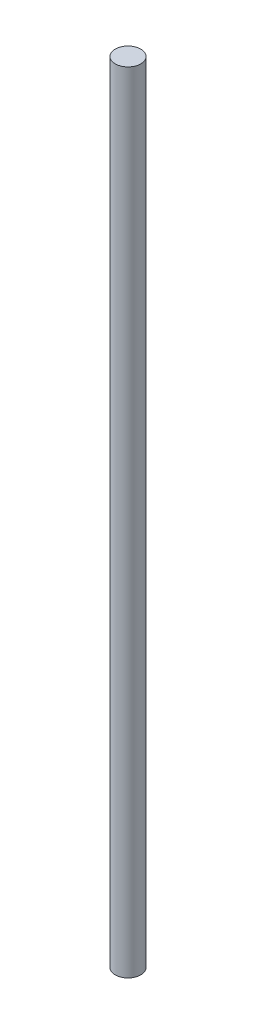
ISO-10303-21;
HEADER;
FILE_DESCRIPTION(('STEP AP214'),'2;1');
FILE_NAME('part.step','',(''),(''),'','','');
FILE_SCHEMA(('AUTOMOTIVE_DESIGN { 1 0 10303 214 1 1 1 1 }'));
ENDSEC;
DATA;
#1=APPLICATION_CONTEXT('core data for automotive mechanical design processes');
#2=APPLICATION_PROTOCOL_DEFINITION('international standard','automotive_design',2000,#1);
#3=PRODUCT_CONTEXT('',#1,'mechanical');
#4=PRODUCT('Part','Part','',(#3));
#5=PRODUCT_RELATED_PRODUCT_CATEGORY('part','',(#4));
#6=PRODUCT_DEFINITION_FORMATION('','',#4);
#7=PRODUCT_DEFINITION_CONTEXT('part definition',#1,'design');
#8=PRODUCT_DEFINITION('design','',#6,#7);
#9=PRODUCT_DEFINITION_SHAPE('','',#8);
#10=(LENGTH_UNIT() NAMED_UNIT(*) SI_UNIT(.MILLI.,.METRE.));
#11=(NAMED_UNIT(*) PLANE_ANGLE_UNIT() SI_UNIT($,.RADIAN.));
#12=(NAMED_UNIT(*) SI_UNIT($,.STERADIAN.) SOLID_ANGLE_UNIT());
#13=UNCERTAINTY_MEASURE_WITH_UNIT(LENGTH_MEASURE(1.E-05),#10,'distance_accuracy_value','');
#14=(GEOMETRIC_REPRESENTATION_CONTEXT(3) GLOBAL_UNCERTAINTY_ASSIGNED_CONTEXT((#13)) GLOBAL_UNIT_ASSIGNED_CONTEXT((#10,
#11,#12)) REPRESENTATION_CONTEXT('',''));
#15=CARTESIAN_POINT('',(0.,0.,0.));
#16=DIRECTION('',(0.,0.,1.));
#17=DIRECTION('',(1.,0.,0.));
#18=AXIS2_PLACEMENT_3D('',#15,#16,#17);
#19=CARTESIAN_POINT('',(0.,92.4,0.));
#20=DIRECTION('',(0.,-1.,0.));
#21=DIRECTION('',(0.,0.,-1.));
#22=AXIS2_PLACEMENT_3D('',#19,#20,#21);
#23=CYLINDRICAL_SURFACE('',#22,1.5);
#24=CARTESIAN_POINT('',(0.,92.4,0.));
#25=DIRECTION('',(0.,1.,0.));
#26=DIRECTION('',(0.,0.,1.));
#27=AXIS2_PLACEMENT_3D('',#24,#25,#26);
#28=CIRCLE('',#27,1.5);
#29=CARTESIAN_POINT('',(0.,92.4,1.5));
#30=VERTEX_POINT('',#29);
#31=EDGE_CURVE('E10',#30,#30,#28,.T.);
#32=ORIENTED_EDGE('',*,*,#31,.F.);
#33=EDGE_LOOP('',(#32));
#34=FACE_BOUND('',#33,.T.);
#35=CARTESIAN_POINT('',(0.,0.,0.));
#36=DIRECTION('',(0.,1.,0.));
#37=DIRECTION('',(0.,0.,1.));
#38=AXIS2_PLACEMENT_3D('',#35,#36,#37);
#39=CIRCLE('',#38,1.5);
#40=CARTESIAN_POINT('',(0.,0.,1.5));
#41=VERTEX_POINT('',#40);
#42=EDGE_CURVE('E34',#41,#41,#39,.T.);
#43=ORIENTED_EDGE('',*,*,#42,.T.);
#44=EDGE_LOOP('',(#43));
#45=FACE_BOUND('',#44,.T.);
#46=ADVANCED_FACE('F31',(#34,#45),#23,.T.);
#47=CARTESIAN_POINT('',(0.,92.4,0.));
#48=DIRECTION('',(0.,1.,0.));
#49=DIRECTION('',(0.,0.,1.));
#50=AXIS2_PLACEMENT_3D('',#47,#48,#49);
#51=PLANE('',#50);
#52=ORIENTED_EDGE('',*,*,#31,.T.);
#53=EDGE_LOOP('',(#52));
#54=FACE_BOUND('',#53,.T.);
#55=ADVANCED_FACE('F46',(#54),#51,.T.);
#56=CARTESIAN_POINT('',(0.,0.,0.));
#57=DIRECTION('',(0.,1.,0.));
#58=DIRECTION('',(0.,0.,1.));
#59=AXIS2_PLACEMENT_3D('',#56,#57,#58);
#60=PLANE('',#59);
#61=ORIENTED_EDGE('',*,*,#42,.F.);
#62=EDGE_LOOP('',(#61));
#63=FACE_BOUND('',#62,.T.);
#64=ADVANCED_FACE('F44',(#63),#60,.F.);
#65=CLOSED_SHELL('',(#46,#55,#64));
#66=MANIFOLD_SOLID_BREP('B2',#65);
#67=ADVANCED_BREP_SHAPE_REPRESENTATION('',(#18,#66),#14);
#68=SHAPE_DEFINITION_REPRESENTATION(#9,#67);
ENDSEC;
END-ISO-10303-21;
